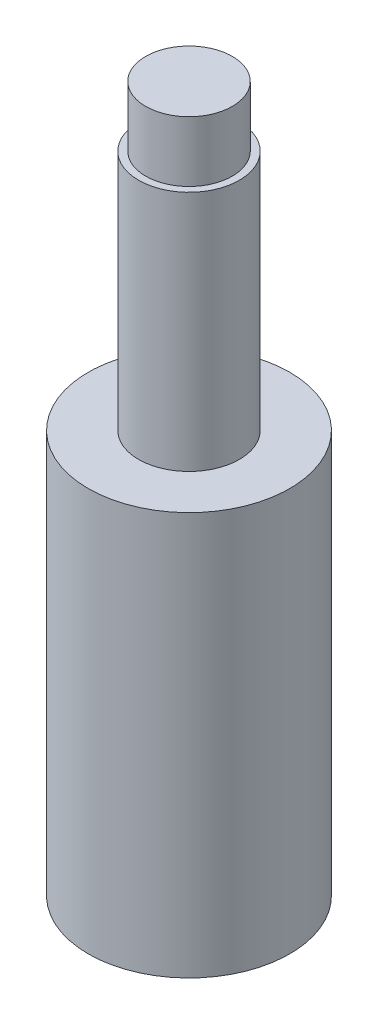
ISO-10303-21;
HEADER;
FILE_DESCRIPTION(('STEP AP214'),'2;1');
FILE_NAME('part.step','',(''),(''),'','','');
FILE_SCHEMA(('AUTOMOTIVE_DESIGN { 1 0 10303 214 1 1 1 1 }'));
ENDSEC;
DATA;
#1=APPLICATION_CONTEXT('core data for automotive mechanical design processes');
#2=APPLICATION_PROTOCOL_DEFINITION('international standard','automotive_design',2000,#1);
#3=PRODUCT_CONTEXT('',#1,'mechanical');
#4=PRODUCT('Part','Part','',(#3));
#5=PRODUCT_RELATED_PRODUCT_CATEGORY('part','',(#4));
#6=PRODUCT_DEFINITION_FORMATION('','',#4);
#7=PRODUCT_DEFINITION_CONTEXT('part definition',#1,'design');
#8=PRODUCT_DEFINITION('design','',#6,#7);
#9=PRODUCT_DEFINITION_SHAPE('','',#8);
#10=(LENGTH_UNIT() NAMED_UNIT(*) SI_UNIT(.MILLI.,.METRE.));
#11=(NAMED_UNIT(*) PLANE_ANGLE_UNIT() SI_UNIT($,.RADIAN.));
#12=(NAMED_UNIT(*) SI_UNIT($,.STERADIAN.) SOLID_ANGLE_UNIT());
#13=UNCERTAINTY_MEASURE_WITH_UNIT(LENGTH_MEASURE(1.E-05),#10,'distance_accuracy_value','');
#14=(GEOMETRIC_REPRESENTATION_CONTEXT(3) GLOBAL_UNCERTAINTY_ASSIGNED_CONTEXT((#13)) GLOBAL_UNIT_ASSIGNED_CONTEXT((#10,
#11,#12)) REPRESENTATION_CONTEXT('',''));
#15=CARTESIAN_POINT('',(0.,0.,0.));
#16=DIRECTION('',(0.,0.,1.));
#17=DIRECTION('',(1.,0.,0.));
#18=AXIS2_PLACEMENT_3D('',#15,#16,#17);
#19=CARTESIAN_POINT('',(0.,20.,0.));
#20=DIRECTION('',(0.,-1.,0.));
#21=DIRECTION('',(0.,0.,-1.));
#22=AXIS2_PLACEMENT_3D('',#19,#20,#21);
#23=CYLINDRICAL_SURFACE('',#22,5.);
#24=CARTESIAN_POINT('',(0.,20.,0.));
#25=DIRECTION('',(0.,1.,0.));
#26=DIRECTION('',(0.,0.,1.));
#27=AXIS2_PLACEMENT_3D('',#24,#25,#26);
#28=CIRCLE('',#27,5.);
#29=CARTESIAN_POINT('',(0.,20.,5.));
#30=VERTEX_POINT('',#29);
#31=EDGE_CURVE('E53',#30,#30,#28,.T.);
#32=ORIENTED_EDGE('',*,*,#31,.F.);
#33=EDGE_LOOP('',(#32));
#34=FACE_BOUND('',#33,.T.);
#35=CARTESIAN_POINT('',(0.,0.,0.));
#36=DIRECTION('',(0.,1.,0.));
#37=DIRECTION('',(0.,0.,1.));
#38=AXIS2_PLACEMENT_3D('',#35,#36,#37);
#39=CIRCLE('',#38,5.);
#40=CARTESIAN_POINT('',(0.,0.,5.));
#41=VERTEX_POINT('',#40);
#42=EDGE_CURVE('E42',#41,#41,#39,.T.);
#43=ORIENTED_EDGE('',*,*,#42,.T.);
#44=EDGE_LOOP('',(#43));
#45=FACE_BOUND('',#44,.T.);
#46=ADVANCED_FACE('F39',(#34,#45),#23,.T.);
#47=CARTESIAN_POINT('',(0.,20.,0.));
#48=DIRECTION('',(0.,1.,0.));
#49=DIRECTION('',(0.,0.,1.));
#50=AXIS2_PLACEMENT_3D('',#47,#48,#49);
#51=PLANE('',#50);
#52=CARTESIAN_POINT('',(0.,20.,0.));
#53=DIRECTION('',(0.,1.,0.));
#54=DIRECTION('',(0.,0.,1.));
#55=AXIS2_PLACEMENT_3D('',#52,#53,#54);
#56=CIRCLE('',#55,2.5);
#57=CARTESIAN_POINT('',(0.,20.,2.5));
#58=VERTEX_POINT('',#57);
#59=EDGE_CURVE('E47',#58,#58,#56,.T.);
#60=ORIENTED_EDGE('',*,*,#59,.F.);
#61=EDGE_LOOP('',(#60));
#62=FACE_BOUND('',#61,.T.);
#63=ORIENTED_EDGE('',*,*,#31,.T.);
#64=EDGE_LOOP('',(#63));
#65=FACE_BOUND('',#64,.T.);
#66=ADVANCED_FACE('F73',(#62,#65),#51,.T.);
#67=CARTESIAN_POINT('',(0.,0.,0.));
#68=DIRECTION('',(0.,1.,0.));
#69=DIRECTION('',(0.,0.,1.));
#70=AXIS2_PLACEMENT_3D('',#67,#68,#69);
#71=PLANE('',#70);
#72=ORIENTED_EDGE('',*,*,#42,.F.);
#73=EDGE_LOOP('',(#72));
#74=FACE_BOUND('',#73,.T.);
#75=ADVANCED_FACE('F70',(#74),#71,.F.);
#76=CARTESIAN_POINT('',(0.,32.,0.));
#77=DIRECTION('',(0.,-1.,0.));
#78=DIRECTION('',(0.,0.,-1.));
#79=AXIS2_PLACEMENT_3D('',#76,#77,#78);
#80=CYLINDRICAL_SURFACE('',#79,2.5);
#81=CARTESIAN_POINT('',(0.,32.,0.));
#82=DIRECTION('',(0.,1.,0.));
#83=DIRECTION('',(0.,0.,1.));
#84=AXIS2_PLACEMENT_3D('',#81,#82,#83);
#85=CIRCLE('',#84,2.5);
#86=CARTESIAN_POINT('',(0.,32.,2.5));
#87=VERTEX_POINT('',#86);
#88=EDGE_CURVE('E58',#87,#87,#85,.T.);
#89=ORIENTED_EDGE('',*,*,#88,.F.);
#90=EDGE_LOOP('',(#89));
#91=FACE_BOUND('',#90,.T.);
#92=ORIENTED_EDGE('',*,*,#59,.T.);
#93=EDGE_LOOP('',(#92));
#94=FACE_BOUND('',#93,.T.);
#95=ADVANCED_FACE('F72',(#91,#94),#80,.T.);
#96=CARTESIAN_POINT('',(0.,32.,0.));
#97=DIRECTION('',(0.,1.,0.));
#98=DIRECTION('',(0.,0.,1.));
#99=AXIS2_PLACEMENT_3D('',#96,#97,#98);
#100=PLANE('',#99);
#101=CARTESIAN_POINT('',(0.,32.,0.));
#102=DIRECTION('',(0.,1.,0.));
#103=DIRECTION('',(0.,0.,1.));
#104=AXIS2_PLACEMENT_3D('',#101,#102,#103);
#105=CIRCLE('',#104,2.15);
#106=CARTESIAN_POINT('',(0.,32.,2.15));
#107=VERTEX_POINT('',#106);
#108=EDGE_CURVE('E10',#107,#107,#105,.T.);
#109=ORIENTED_EDGE('',*,*,#108,.F.);
#110=EDGE_LOOP('',(#109));
#111=FACE_BOUND('',#110,.T.);
#112=ORIENTED_EDGE('',*,*,#88,.T.);
#113=EDGE_LOOP('',(#112));
#114=FACE_BOUND('',#113,.T.);
#115=ADVANCED_FACE('F78',(#111,#114),#100,.T.);
#116=CARTESIAN_POINT('',(0.,35.,0.));
#117=DIRECTION('',(0.,-1.,0.));
#118=DIRECTION('',(0.,0.,-1.));
#119=AXIS2_PLACEMENT_3D('',#116,#117,#118);
#120=CYLINDRICAL_SURFACE('',#119,2.15);
#121=CARTESIAN_POINT('',(0.,35.,0.));
#122=DIRECTION('',(0.,1.,0.));
#123=DIRECTION('',(0.,0.,1.));
#124=AXIS2_PLACEMENT_3D('',#121,#122,#123);
#125=CIRCLE('',#124,2.15);
#126=CARTESIAN_POINT('',(0.,35.,2.15));
#127=VERTEX_POINT('',#126);
#128=EDGE_CURVE('E57',#127,#127,#125,.T.);
#129=ORIENTED_EDGE('',*,*,#128,.F.);
#130=EDGE_LOOP('',(#129));
#131=FACE_BOUND('',#130,.T.);
#132=ORIENTED_EDGE('',*,*,#108,.T.);
#133=EDGE_LOOP('',(#132));
#134=FACE_BOUND('',#133,.T.);
#135=ADVANCED_FACE('F108',(#131,#134),#120,.T.);
#136=CARTESIAN_POINT('',(0.,35.,0.));
#137=DIRECTION('',(0.,1.,0.));
#138=DIRECTION('',(0.,0.,1.));
#139=AXIS2_PLACEMENT_3D('',#136,#137,#138);
#140=PLANE('',#139);
#141=ORIENTED_EDGE('',*,*,#128,.T.);
#142=EDGE_LOOP('',(#141));
#143=FACE_BOUND('',#142,.T.);
#144=ADVANCED_FACE('F118',(#143),#140,.T.);
#145=CLOSED_SHELL('',(#46,#66,#75,#95,#115,#135,#144));
#146=MANIFOLD_SOLID_BREP('B2',#145);
#147=ADVANCED_BREP_SHAPE_REPRESENTATION('',(#18,#146),#14);
#148=SHAPE_DEFINITION_REPRESENTATION(#9,#147);
ENDSEC;
END-ISO-10303-21;
